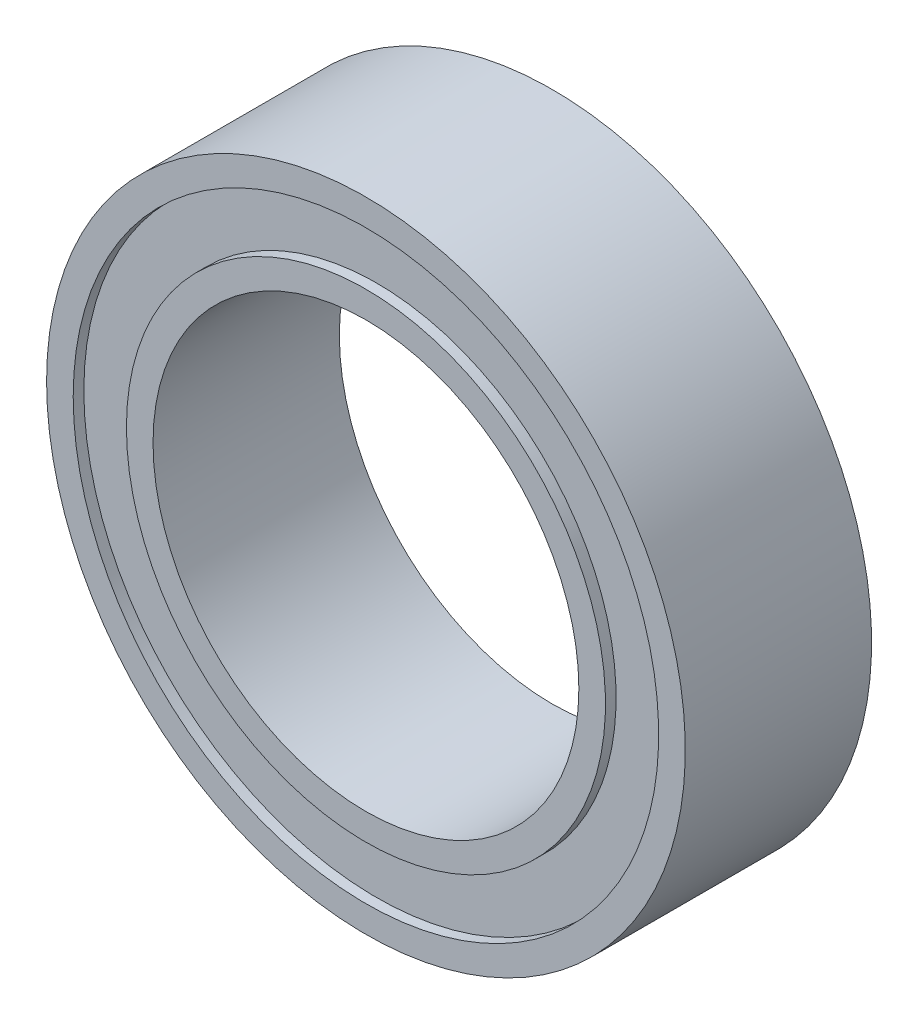
ISO-10303-21;
HEADER;
FILE_DESCRIPTION(('STEP AP214'),'2;1');
FILE_NAME('part.step','',(''),(''),'','','');
FILE_SCHEMA(('AUTOMOTIVE_DESIGN { 1 0 10303 214 1 1 1 1 }'));
ENDSEC;
DATA;
#1=APPLICATION_CONTEXT('core data for automotive mechanical design processes');
#2=APPLICATION_PROTOCOL_DEFINITION('international standard','automotive_design',2000,#1);
#3=PRODUCT_CONTEXT('',#1,'mechanical');
#4=PRODUCT('Part','Part','',(#3));
#5=PRODUCT_RELATED_PRODUCT_CATEGORY('part','',(#4));
#6=PRODUCT_DEFINITION_FORMATION('','',#4);
#7=PRODUCT_DEFINITION_CONTEXT('part definition',#1,'design');
#8=PRODUCT_DEFINITION('design','',#6,#7);
#9=PRODUCT_DEFINITION_SHAPE('','',#8);
#10=(LENGTH_UNIT() NAMED_UNIT(*) SI_UNIT(.MILLI.,.METRE.));
#11=(NAMED_UNIT(*) PLANE_ANGLE_UNIT() SI_UNIT($,.RADIAN.));
#12=(NAMED_UNIT(*) SI_UNIT($,.STERADIAN.) SOLID_ANGLE_UNIT());
#13=UNCERTAINTY_MEASURE_WITH_UNIT(LENGTH_MEASURE(1.E-05),#10,'distance_accuracy_value','');
#14=(GEOMETRIC_REPRESENTATION_CONTEXT(3) GLOBAL_UNCERTAINTY_ASSIGNED_CONTEXT((#13)) GLOBAL_UNIT_ASSIGNED_CONTEXT((#10,
#11,#12)) REPRESENTATION_CONTEXT('',''));
#15=CARTESIAN_POINT('',(0.,0.,0.));
#16=DIRECTION('',(0.,0.,1.));
#17=DIRECTION('',(1.,0.,0.));
#18=AXIS2_PLACEMENT_3D('',#15,#16,#17);
#19=CARTESIAN_POINT('',(0.,0.,-1.75));
#20=DIRECTION('',(0.,0.,-1.));
#21=DIRECTION('',(-1.,0.,0.));
#22=AXIS2_PLACEMENT_3D('',#19,#20,#21);
#23=CYLINDRICAL_SURFACE('',#22,4.);
#24=CARTESIAN_POINT('',(0.,0.,1.75));
#25=DIRECTION('',(0.,0.,-1.));
#26=DIRECTION('',(-1.,0.,0.));
#27=AXIS2_PLACEMENT_3D('',#24,#25,#26);
#28=CIRCLE('',#27,4.);
#29=CARTESIAN_POINT('',(-4.,0.,1.75));
#30=VERTEX_POINT('',#29);
#31=EDGE_CURVE('E10',#30,#30,#28,.T.);
#32=ORIENTED_EDGE('',*,*,#31,.F.);
#33=EDGE_LOOP('',(#32));
#34=FACE_BOUND('',#33,.T.);
#35=CARTESIAN_POINT('',(0.,0.,-1.75));
#36=DIRECTION('',(0.,0.,-1.));
#37=DIRECTION('',(-1.,0.,0.));
#38=AXIS2_PLACEMENT_3D('',#35,#36,#37);
#39=CIRCLE('',#38,4.);
#40=CARTESIAN_POINT('',(-4.,0.,-1.75));
#41=VERTEX_POINT('',#40);
#42=EDGE_CURVE('E72',#41,#41,#39,.T.);
#43=ORIENTED_EDGE('',*,*,#42,.T.);
#44=EDGE_LOOP('',(#43));
#45=FACE_BOUND('',#44,.T.);
#46=ADVANCED_FACE('F32',(#34,#45),#23,.F.);
#47=CARTESIAN_POINT('',(4.,0.,1.75));
#48=DIRECTION('',(0.,0.,-1.));
#49=DIRECTION('',(-1.,0.,0.));
#50=AXIS2_PLACEMENT_3D('',#47,#48,#49);
#51=PLANE('',#50);
#52=CARTESIAN_POINT('',(0.,0.,1.75));
#53=DIRECTION('',(0.,0.,-1.));
#54=DIRECTION('',(-1.,0.,0.));
#55=AXIS2_PLACEMENT_3D('',#52,#53,#54);
#56=CIRCLE('',#55,4.5);
#57=CARTESIAN_POINT('',(-4.5,0.,1.75));
#58=VERTEX_POINT('',#57);
#59=EDGE_CURVE('E38',#58,#58,#56,.T.);
#60=ORIENTED_EDGE('',*,*,#59,.F.);
#61=EDGE_LOOP('',(#60));
#62=FACE_BOUND('',#61,.T.);
#63=ORIENTED_EDGE('',*,*,#31,.T.);
#64=EDGE_LOOP('',(#63));
#65=FACE_BOUND('',#64,.T.);
#66=ADVANCED_FACE('F133',(#62,#65),#51,.F.);
#67=CARTESIAN_POINT('',(0.,0.,-1.75));
#68=DIRECTION('',(0.,0.,-1.));
#69=DIRECTION('',(-1.,0.,0.));
#70=AXIS2_PLACEMENT_3D('',#67,#68,#69);
#71=CYLINDRICAL_SURFACE('',#70,4.5);
#72=CARTESIAN_POINT('',(0.,0.,1.55));
#73=DIRECTION('',(0.,0.,-1.));
#74=DIRECTION('',(-1.,0.,0.));
#75=AXIS2_PLACEMENT_3D('',#72,#73,#74);
#76=CIRCLE('',#75,4.5);
#77=CARTESIAN_POINT('',(-4.5,0.,1.55));
#78=VERTEX_POINT('',#77);
#79=EDGE_CURVE('E42',#78,#78,#76,.T.);
#80=ORIENTED_EDGE('',*,*,#79,.F.);
#81=EDGE_LOOP('',(#80));
#82=FACE_BOUND('',#81,.T.);
#83=ORIENTED_EDGE('',*,*,#59,.T.);
#84=EDGE_LOOP('',(#83));
#85=FACE_BOUND('',#84,.T.);
#86=ADVANCED_FACE('F128',(#82,#85),#71,.T.);
#87=CARTESIAN_POINT('',(5.5,0.,1.55));
#88=DIRECTION('',(0.,0.,-1.));
#89=DIRECTION('',(-1.,0.,0.));
#90=AXIS2_PLACEMENT_3D('',#87,#88,#89);
#91=PLANE('',#90);
#92=CARTESIAN_POINT('',(0.,0.,1.55));
#93=DIRECTION('',(0.,0.,-1.));
#94=DIRECTION('',(-1.,0.,0.));
#95=AXIS2_PLACEMENT_3D('',#92,#93,#94);
#96=CIRCLE('',#95,5.5);
#97=CARTESIAN_POINT('',(-5.5,0.,1.55));
#98=VERTEX_POINT('',#97);
#99=EDGE_CURVE('E46',#98,#98,#96,.T.);
#100=ORIENTED_EDGE('',*,*,#99,.F.);
#101=EDGE_LOOP('',(#100));
#102=FACE_BOUND('',#101,.T.);
#103=ORIENTED_EDGE('',*,*,#79,.T.);
#104=EDGE_LOOP('',(#103));
#105=FACE_BOUND('',#104,.T.);
#106=ADVANCED_FACE('F122',(#102,#105),#91,.F.);
#107=CARTESIAN_POINT('',(0.,0.,-1.75));
#108=DIRECTION('',(0.,0.,-1.));
#109=DIRECTION('',(-1.,0.,0.));
#110=AXIS2_PLACEMENT_3D('',#107,#108,#109);
#111=CYLINDRICAL_SURFACE('',#110,5.5);
#112=CARTESIAN_POINT('',(0.,0.,1.75));
#113=DIRECTION('',(0.,0.,-1.));
#114=DIRECTION('',(-1.,0.,0.));
#115=AXIS2_PLACEMENT_3D('',#112,#113,#114);
#116=CIRCLE('',#115,5.5);
#117=CARTESIAN_POINT('',(-5.5,0.,1.75));
#118=VERTEX_POINT('',#117);
#119=EDGE_CURVE('E51',#118,#118,#116,.T.);
#120=ORIENTED_EDGE('',*,*,#119,.F.);
#121=EDGE_LOOP('',(#120));
#122=FACE_BOUND('',#121,.T.);
#123=ORIENTED_EDGE('',*,*,#99,.T.);
#124=EDGE_LOOP('',(#123));
#125=FACE_BOUND('',#124,.T.);
#126=ADVANCED_FACE('F116',(#122,#125),#111,.F.);
#127=CARTESIAN_POINT('',(5.5,0.,1.75));
#128=DIRECTION('',(0.,0.,-1.));
#129=DIRECTION('',(-1.,0.,0.));
#130=AXIS2_PLACEMENT_3D('',#127,#128,#129);
#131=PLANE('',#130);
#132=CARTESIAN_POINT('',(0.,0.,1.75));
#133=DIRECTION('',(0.,0.,-1.));
#134=DIRECTION('',(-1.,0.,0.));
#135=AXIS2_PLACEMENT_3D('',#132,#133,#134);
#136=CIRCLE('',#135,6.);
#137=CARTESIAN_POINT('',(-6.,0.,1.75));
#138=VERTEX_POINT('',#137);
#139=EDGE_CURVE('E54',#138,#138,#136,.T.);
#140=ORIENTED_EDGE('',*,*,#139,.F.);
#141=EDGE_LOOP('',(#140));
#142=FACE_BOUND('',#141,.T.);
#143=ORIENTED_EDGE('',*,*,#119,.T.);
#144=EDGE_LOOP('',(#143));
#145=FACE_BOUND('',#144,.T.);
#146=ADVANCED_FACE('F110',(#142,#145),#131,.F.);
#147=CARTESIAN_POINT('',(0.,0.,-1.75));
#148=DIRECTION('',(0.,0.,-1.));
#149=DIRECTION('',(-1.,0.,0.));
#150=AXIS2_PLACEMENT_3D('',#147,#148,#149);
#151=CYLINDRICAL_SURFACE('',#150,6.);
#152=CARTESIAN_POINT('',(0.,0.,-1.75));
#153=DIRECTION('',(0.,0.,-1.));
#154=DIRECTION('',(-1.,0.,0.));
#155=AXIS2_PLACEMENT_3D('',#152,#153,#154);
#156=CIRCLE('',#155,6.);
#157=CARTESIAN_POINT('',(-6.,0.,-1.75));
#158=VERTEX_POINT('',#157);
#159=EDGE_CURVE('E57',#158,#158,#156,.T.);
#160=ORIENTED_EDGE('',*,*,#159,.F.);
#161=EDGE_LOOP('',(#160));
#162=FACE_BOUND('',#161,.T.);
#163=ORIENTED_EDGE('',*,*,#139,.T.);
#164=EDGE_LOOP('',(#163));
#165=FACE_BOUND('',#164,.T.);
#166=ADVANCED_FACE('F104',(#162,#165),#151,.T.);
#167=CARTESIAN_POINT('',(5.5,0.,-1.75));
#168=DIRECTION('',(0.,0.,1.));
#169=DIRECTION('',(1.,0.,0.));
#170=AXIS2_PLACEMENT_3D('',#167,#168,#169);
#171=PLANE('',#170);
#172=CARTESIAN_POINT('',(0.,0.,-1.75));
#173=DIRECTION('',(0.,0.,-1.));
#174=DIRECTION('',(-1.,0.,0.));
#175=AXIS2_PLACEMENT_3D('',#172,#173,#174);
#176=CIRCLE('',#175,5.5);
#177=CARTESIAN_POINT('',(-5.5,0.,-1.75));
#178=VERTEX_POINT('',#177);
#179=EDGE_CURVE('E60',#178,#178,#176,.T.);
#180=ORIENTED_EDGE('',*,*,#179,.F.);
#181=EDGE_LOOP('',(#180));
#182=FACE_BOUND('',#181,.T.);
#183=ORIENTED_EDGE('',*,*,#159,.T.);
#184=EDGE_LOOP('',(#183));
#185=FACE_BOUND('',#184,.T.);
#186=ADVANCED_FACE('F98',(#182,#185),#171,.F.);
#187=CARTESIAN_POINT('',(0.,0.,-1.75));
#188=DIRECTION('',(0.,0.,-1.));
#189=DIRECTION('',(-1.,0.,0.));
#190=AXIS2_PLACEMENT_3D('',#187,#188,#189);
#191=CYLINDRICAL_SURFACE('',#190,5.5);
#192=CARTESIAN_POINT('',(0.,0.,-1.55));
#193=DIRECTION('',(0.,0.,-1.));
#194=DIRECTION('',(-1.,0.,0.));
#195=AXIS2_PLACEMENT_3D('',#192,#193,#194);
#196=CIRCLE('',#195,5.5);
#197=CARTESIAN_POINT('',(-5.5,0.,-1.55));
#198=VERTEX_POINT('',#197);
#199=EDGE_CURVE('E63',#198,#198,#196,.T.);
#200=ORIENTED_EDGE('',*,*,#199,.F.);
#201=EDGE_LOOP('',(#200));
#202=FACE_BOUND('',#201,.T.);
#203=ORIENTED_EDGE('',*,*,#179,.T.);
#204=EDGE_LOOP('',(#203));
#205=FACE_BOUND('',#204,.T.);
#206=ADVANCED_FACE('F92',(#202,#205),#191,.F.);
#207=CARTESIAN_POINT('',(4.5,0.,-1.55));
#208=DIRECTION('',(0.,0.,1.));
#209=DIRECTION('',(1.,0.,0.));
#210=AXIS2_PLACEMENT_3D('',#207,#208,#209);
#211=PLANE('',#210);
#212=CARTESIAN_POINT('',(0.,0.,-1.55));
#213=DIRECTION('',(0.,0.,-1.));
#214=DIRECTION('',(-1.,0.,0.));
#215=AXIS2_PLACEMENT_3D('',#212,#213,#214);
#216=CIRCLE('',#215,4.5);
#217=CARTESIAN_POINT('',(-4.5,0.,-1.55));
#218=VERTEX_POINT('',#217);
#219=EDGE_CURVE('E66',#218,#218,#216,.T.);
#220=ORIENTED_EDGE('',*,*,#219,.F.);
#221=EDGE_LOOP('',(#220));
#222=FACE_BOUND('',#221,.T.);
#223=ORIENTED_EDGE('',*,*,#199,.T.);
#224=EDGE_LOOP('',(#223));
#225=FACE_BOUND('',#224,.T.);
#226=ADVANCED_FACE('F86',(#222,#225),#211,.F.);
#227=CARTESIAN_POINT('',(0.,0.,-1.75));
#228=DIRECTION('',(0.,0.,-1.));
#229=DIRECTION('',(-1.,0.,0.));
#230=AXIS2_PLACEMENT_3D('',#227,#228,#229);
#231=CYLINDRICAL_SURFACE('',#230,4.5);
#232=CARTESIAN_POINT('',(0.,0.,-1.75));
#233=DIRECTION('',(0.,0.,-1.));
#234=DIRECTION('',(-1.,0.,0.));
#235=AXIS2_PLACEMENT_3D('',#232,#233,#234);
#236=CIRCLE('',#235,4.5);
#237=CARTESIAN_POINT('',(-4.5,0.,-1.75));
#238=VERTEX_POINT('',#237);
#239=EDGE_CURVE('E69',#238,#238,#236,.T.);
#240=ORIENTED_EDGE('',*,*,#239,.F.);
#241=EDGE_LOOP('',(#240));
#242=FACE_BOUND('',#241,.T.);
#243=ORIENTED_EDGE('',*,*,#219,.T.);
#244=EDGE_LOOP('',(#243));
#245=FACE_BOUND('',#244,.T.);
#246=ADVANCED_FACE('F80',(#242,#245),#231,.T.);
#247=CARTESIAN_POINT('',(4.,0.,-1.75));
#248=DIRECTION('',(0.,0.,1.));
#249=DIRECTION('',(1.,0.,0.));
#250=AXIS2_PLACEMENT_3D('',#247,#248,#249);
#251=PLANE('',#250);
#252=ORIENTED_EDGE('',*,*,#42,.F.);
#253=EDGE_LOOP('',(#252));
#254=FACE_BOUND('',#253,.T.);
#255=ORIENTED_EDGE('',*,*,#239,.T.);
#256=EDGE_LOOP('',(#255));
#257=FACE_BOUND('',#256,.T.);
#258=ADVANCED_FACE('F77',(#254,#257),#251,.F.);
#259=CLOSED_SHELL('',(#46,#66,#86,#106,#126,#146,#166,#186,#206,#226,#246,#258));
#260=MANIFOLD_SOLID_BREP('B2',#259);
#261=ADVANCED_BREP_SHAPE_REPRESENTATION('',(#18,#260),#14);
#262=SHAPE_DEFINITION_REPRESENTATION(#9,#261);
ENDSEC;
END-ISO-10303-21;
